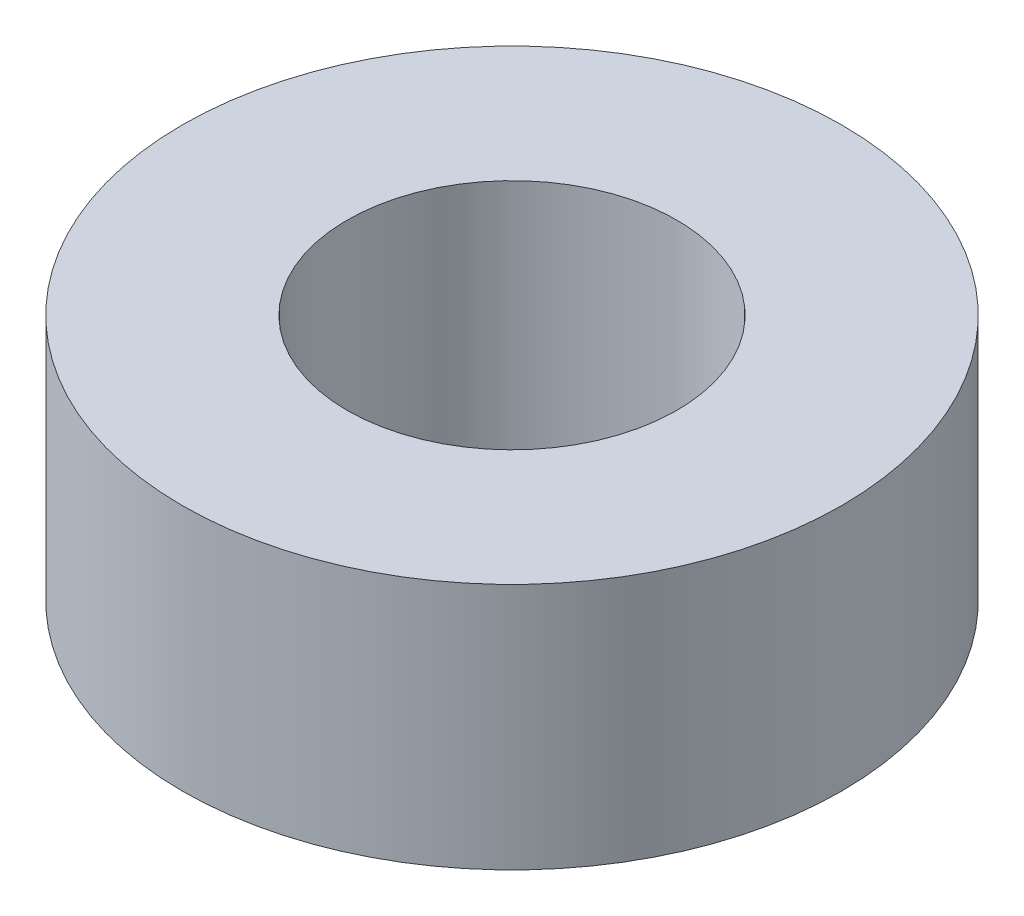
ISO-10303-21;
HEADER;
FILE_DESCRIPTION(('STEP AP214'),'2;1');
FILE_NAME('part.step','',(''),(''),'','','');
FILE_SCHEMA(('AUTOMOTIVE_DESIGN { 1 0 10303 214 1 1 1 1 }'));
ENDSEC;
DATA;
#1=APPLICATION_CONTEXT('core data for automotive mechanical design processes');
#2=APPLICATION_PROTOCOL_DEFINITION('international standard','automotive_design',2000,#1);
#3=PRODUCT_CONTEXT('',#1,'mechanical');
#4=PRODUCT('Part','Part','',(#3));
#5=PRODUCT_RELATED_PRODUCT_CATEGORY('part','',(#4));
#6=PRODUCT_DEFINITION_FORMATION('','',#4);
#7=PRODUCT_DEFINITION_CONTEXT('part definition',#1,'design');
#8=PRODUCT_DEFINITION('design','',#6,#7);
#9=PRODUCT_DEFINITION_SHAPE('','',#8);
#10=(LENGTH_UNIT() NAMED_UNIT(*) SI_UNIT(.MILLI.,.METRE.));
#11=(NAMED_UNIT(*) PLANE_ANGLE_UNIT() SI_UNIT($,.RADIAN.));
#12=(NAMED_UNIT(*) SI_UNIT($,.STERADIAN.) SOLID_ANGLE_UNIT());
#13=UNCERTAINTY_MEASURE_WITH_UNIT(LENGTH_MEASURE(1.E-05),#10,'distance_accuracy_value','');
#14=(GEOMETRIC_REPRESENTATION_CONTEXT(3) GLOBAL_UNCERTAINTY_ASSIGNED_CONTEXT((#13)) GLOBAL_UNIT_ASSIGNED_CONTEXT((#10,
#11,#12)) REPRESENTATION_CONTEXT('',''));
#15=CARTESIAN_POINT('',(0.,0.,0.));
#16=DIRECTION('',(0.,0.,1.));
#17=DIRECTION('',(1.,0.,0.));
#18=AXIS2_PLACEMENT_3D('',#15,#16,#17);
#19=CARTESIAN_POINT('',(0.,4.7625,0.));
#20=DIRECTION('',(0.,1.,0.));
#21=DIRECTION('',(0.,0.,1.));
#22=AXIS2_PLACEMENT_3D('',#19,#20,#21);
#23=PLANE('',#22);
#24=CARTESIAN_POINT('',(0.,4.7625,0.));
#25=DIRECTION('',(0.,1.,0.));
#26=DIRECTION('',(0.,0.,1.));
#27=AXIS2_PLACEMENT_3D('',#24,#25,#26);
#28=CIRCLE('',#27,6.35);
#29=CARTESIAN_POINT('',(0.,4.7625,6.35));
#30=VERTEX_POINT('',#29);
#31=EDGE_CURVE('E10',#30,#30,#28,.T.);
#32=ORIENTED_EDGE('',*,*,#31,.T.);
#33=EDGE_LOOP('',(#32));
#34=FACE_BOUND('',#33,.T.);
#35=CARTESIAN_POINT('',(0.,4.7625,0.));
#36=DIRECTION('',(0.,1.,0.));
#37=DIRECTION('',(0.,0.,1.));
#38=AXIS2_PLACEMENT_3D('',#35,#36,#37);
#39=CIRCLE('',#38,3.175);
#40=CARTESIAN_POINT('',(0.,4.7625,3.175));
#41=VERTEX_POINT('',#40);
#42=EDGE_CURVE('E45',#41,#41,#39,.T.);
#43=ORIENTED_EDGE('',*,*,#42,.F.);
#44=EDGE_LOOP('',(#43));
#45=FACE_BOUND('',#44,.T.);
#46=ADVANCED_FACE('F34',(#34,#45),#23,.T.);
#47=CARTESIAN_POINT('',(0.,0.,0.));
#48=DIRECTION('',(0.,1.,0.));
#49=DIRECTION('',(0.,0.,1.));
#50=AXIS2_PLACEMENT_3D('',#47,#48,#49);
#51=PLANE('',#50);
#52=CARTESIAN_POINT('',(0.,0.,0.));
#53=DIRECTION('',(0.,1.,0.));
#54=DIRECTION('',(0.,0.,1.));
#55=AXIS2_PLACEMENT_3D('',#52,#53,#54);
#56=CIRCLE('',#55,6.35);
#57=CARTESIAN_POINT('',(0.,0.,6.35));
#58=VERTEX_POINT('',#57);
#59=EDGE_CURVE('E38',#58,#58,#56,.T.);
#60=ORIENTED_EDGE('',*,*,#59,.F.);
#61=EDGE_LOOP('',(#60));
#62=FACE_BOUND('',#61,.T.);
#63=CARTESIAN_POINT('',(0.,0.,0.));
#64=DIRECTION('',(0.,1.,0.));
#65=DIRECTION('',(0.,0.,1.));
#66=AXIS2_PLACEMENT_3D('',#63,#64,#65);
#67=CIRCLE('',#66,3.175);
#68=CARTESIAN_POINT('',(0.,0.,3.175));
#69=VERTEX_POINT('',#68);
#70=EDGE_CURVE('E47',#69,#69,#67,.T.);
#71=ORIENTED_EDGE('',*,*,#70,.T.);
#72=EDGE_LOOP('',(#71));
#73=FACE_BOUND('',#72,.T.);
#74=ADVANCED_FACE('F57',(#62,#73),#51,.F.);
#75=CARTESIAN_POINT('',(0.,4.7625,0.));
#76=DIRECTION('',(0.,-1.,0.));
#77=DIRECTION('',(0.,0.,-1.));
#78=AXIS2_PLACEMENT_3D('',#75,#76,#77);
#79=CYLINDRICAL_SURFACE('',#78,6.35);
#80=ORIENTED_EDGE('',*,*,#31,.F.);
#81=EDGE_LOOP('',(#80));
#82=FACE_BOUND('',#81,.T.);
#83=ORIENTED_EDGE('',*,*,#59,.T.);
#84=EDGE_LOOP('',(#83));
#85=FACE_BOUND('',#84,.T.);
#86=ADVANCED_FACE('F36',(#82,#85),#79,.T.);
#87=CARTESIAN_POINT('',(0.,4.7625,0.));
#88=DIRECTION('',(0.,-1.,0.));
#89=DIRECTION('',(0.,0.,-1.));
#90=AXIS2_PLACEMENT_3D('',#87,#88,#89);
#91=CYLINDRICAL_SURFACE('',#90,3.175);
#92=ORIENTED_EDGE('',*,*,#42,.T.);
#93=EDGE_LOOP('',(#92));
#94=FACE_BOUND('',#93,.T.);
#95=ORIENTED_EDGE('',*,*,#70,.F.);
#96=EDGE_LOOP('',(#95));
#97=FACE_BOUND('',#96,.T.);
#98=ADVANCED_FACE('F53',(#94,#97),#91,.F.);
#99=CLOSED_SHELL('',(#46,#74,#86,#98));
#100=MANIFOLD_SOLID_BREP('B2',#99);
#101=ADVANCED_BREP_SHAPE_REPRESENTATION('',(#18,#100),#14);
#102=SHAPE_DEFINITION_REPRESENTATION(#9,#101);
ENDSEC;
END-ISO-10303-21;
